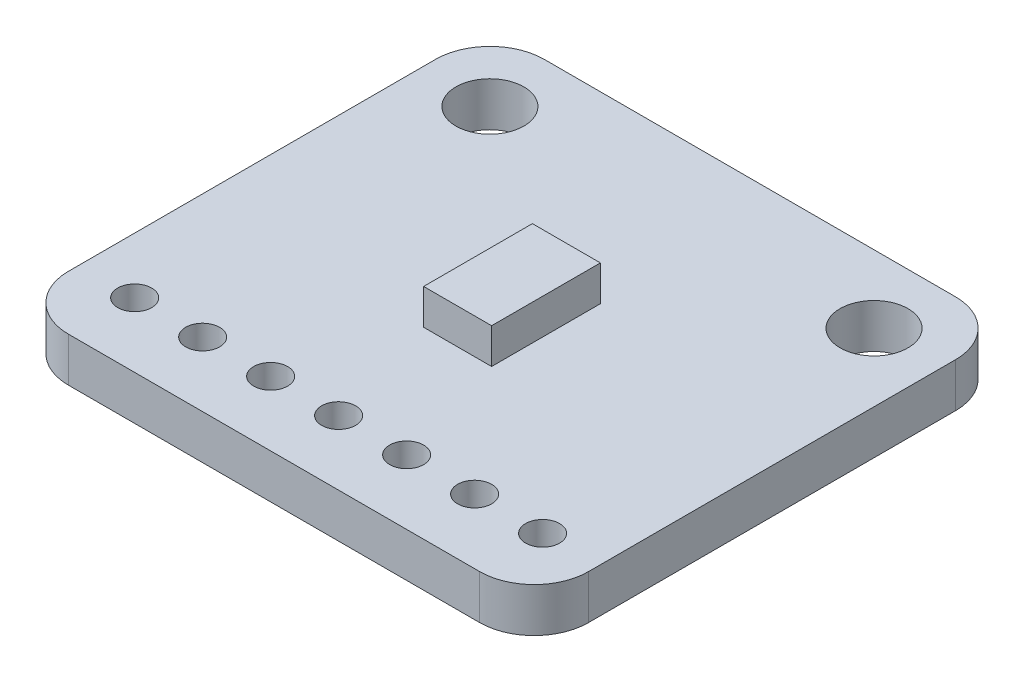
ISO-10303-21;
HEADER;
FILE_DESCRIPTION(('STEP AP214'),'2;1');
FILE_NAME('part.step','',(''),(''),'','','');
FILE_SCHEMA(('AUTOMOTIVE_DESIGN { 1 0 10303 214 1 1 1 1 }'));
ENDSEC;
DATA;
#1=APPLICATION_CONTEXT('core data for automotive mechanical design processes');
#2=APPLICATION_PROTOCOL_DEFINITION('international standard','automotive_design',2000,#1);
#3=PRODUCT_CONTEXT('',#1,'mechanical');
#4=PRODUCT('Part','Part','',(#3));
#5=PRODUCT_RELATED_PRODUCT_CATEGORY('part','',(#4));
#6=PRODUCT_DEFINITION_FORMATION('','',#4);
#7=PRODUCT_DEFINITION_CONTEXT('part definition',#1,'design');
#8=PRODUCT_DEFINITION('design','',#6,#7);
#9=PRODUCT_DEFINITION_SHAPE('','',#8);
#10=(LENGTH_UNIT() NAMED_UNIT(*) SI_UNIT(.MILLI.,.METRE.));
#11=(NAMED_UNIT(*) PLANE_ANGLE_UNIT() SI_UNIT($,.RADIAN.));
#12=(NAMED_UNIT(*) SI_UNIT($,.STERADIAN.) SOLID_ANGLE_UNIT());
#13=UNCERTAINTY_MEASURE_WITH_UNIT(LENGTH_MEASURE(1.E-05),#10,'distance_accuracy_value','');
#14=(GEOMETRIC_REPRESENTATION_CONTEXT(3) GLOBAL_UNCERTAINTY_ASSIGNED_CONTEXT((#13)) GLOBAL_UNIT_ASSIGNED_CONTEXT((#10,
#11,#12)) REPRESENTATION_CONTEXT('',''));
#15=CARTESIAN_POINT('',(0.,0.,0.));
#16=DIRECTION('',(0.,0.,1.));
#17=DIRECTION('',(1.,0.,0.));
#18=AXIS2_PLACEMENT_3D('',#15,#16,#17);
#19=CARTESIAN_POINT('',(2.032,1.651,-2.032));
#20=DIRECTION('',(0.,-1.,0.));
#21=DIRECTION('',(0.,0.,-1.));
#22=AXIS2_PLACEMENT_3D('',#19,#20,#21);
#23=PLANE('',#22);
#24=CARTESIAN_POINT('',(17.3355,1.651,-2.413));
#25=DIRECTION('',(0.,1.,0.));
#26=DIRECTION('',(0.,0.,1.));
#27=AXIS2_PLACEMENT_3D('',#24,#25,#26);
#28=CIRCLE('',#27,0.634999999999999);
#29=CARTESIAN_POINT('',(17.3355,1.651,-1.778));
#30=VERTEX_POINT('',#29);
#31=EDGE_CURVE('E243',#30,#30,#28,.T.);
#32=ORIENTED_EDGE('',*,*,#31,.F.);
#33=EDGE_LOOP('',(#32));
#34=FACE_BOUND('',#33,.T.);
#35=CARTESIAN_POINT('',(14.7955,1.651,-2.413));
#36=DIRECTION('',(0.,1.,0.));
#37=DIRECTION('',(0.,0.,1.));
#38=AXIS2_PLACEMENT_3D('',#35,#36,#37);
#39=CIRCLE('',#38,0.634999999999999);
#40=CARTESIAN_POINT('',(14.7955,1.651,-1.778));
#41=VERTEX_POINT('',#40);
#42=EDGE_CURVE('E237',#41,#41,#39,.T.);
#43=ORIENTED_EDGE('',*,*,#42,.F.);
#44=EDGE_LOOP('',(#43));
#45=FACE_BOUND('',#44,.T.);
#46=CARTESIAN_POINT('',(12.2555,1.651,-2.413));
#47=DIRECTION('',(0.,1.,0.));
#48=DIRECTION('',(0.,0.,1.));
#49=AXIS2_PLACEMENT_3D('',#46,#47,#48);
#50=CIRCLE('',#49,0.634999999999999);
#51=CARTESIAN_POINT('',(12.2555,1.651,-1.778));
#52=VERTEX_POINT('',#51);
#53=EDGE_CURVE('E231',#52,#52,#50,.T.);
#54=ORIENTED_EDGE('',*,*,#53,.F.);
#55=EDGE_LOOP('',(#54));
#56=FACE_BOUND('',#55,.T.);
#57=CARTESIAN_POINT('',(9.7155,1.651,-2.413));
#58=DIRECTION('',(0.,1.,0.));
#59=DIRECTION('',(0.,0.,1.));
#60=AXIS2_PLACEMENT_3D('',#57,#58,#59);
#61=CIRCLE('',#60,0.634999999999999);
#62=CARTESIAN_POINT('',(9.7155,1.651,-1.778));
#63=VERTEX_POINT('',#62);
#64=EDGE_CURVE('E225',#63,#63,#61,.T.);
#65=ORIENTED_EDGE('',*,*,#64,.F.);
#66=EDGE_LOOP('',(#65));
#67=FACE_BOUND('',#66,.T.);
#68=CARTESIAN_POINT('',(7.1755,1.651,-2.413));
#69=DIRECTION('',(0.,1.,0.));
#70=DIRECTION('',(0.,0.,1.));
#71=AXIS2_PLACEMENT_3D('',#68,#69,#70);
#72=CIRCLE('',#71,0.635000000000001);
#73=CARTESIAN_POINT('',(7.1755,1.651,-1.778));
#74=VERTEX_POINT('',#73);
#75=EDGE_CURVE('E219',#74,#74,#72,.T.);
#76=ORIENTED_EDGE('',*,*,#75,.F.);
#77=EDGE_LOOP('',(#76));
#78=FACE_BOUND('',#77,.T.);
#79=CARTESIAN_POINT('',(4.6355,1.651,-2.413));
#80=DIRECTION('',(0.,1.,0.));
#81=DIRECTION('',(0.,0.,1.));
#82=AXIS2_PLACEMENT_3D('',#79,#80,#81);
#83=CIRCLE('',#82,0.635000000000001);
#84=CARTESIAN_POINT('',(4.6355,1.651,-1.778));
#85=VERTEX_POINT('',#84);
#86=EDGE_CURVE('E213',#85,#85,#83,.T.);
#87=ORIENTED_EDGE('',*,*,#86,.F.);
#88=EDGE_LOOP('',(#87));
#89=FACE_BOUND('',#88,.T.);
#90=CARTESIAN_POINT('',(2.0955,1.651,-2.413));
#91=DIRECTION('',(0.,1.,0.));
#92=DIRECTION('',(0.,0.,1.));
#93=AXIS2_PLACEMENT_3D('',#90,#91,#92);
#94=CIRCLE('',#93,0.635);
#95=CARTESIAN_POINT('',(2.0955,1.651,-1.778));
#96=VERTEX_POINT('',#95);
#97=EDGE_CURVE('E207',#96,#96,#94,.T.);
#98=ORIENTED_EDGE('',*,*,#97,.F.);
#99=EDGE_LOOP('',(#98));
#100=FACE_BOUND('',#99,.T.);
#101=CARTESIAN_POINT('',(16.891,1.651,-15.24));
#102=DIRECTION('',(0.,1.,0.));
#103=DIRECTION('',(0.,0.,1.));
#104=AXIS2_PLACEMENT_3D('',#101,#102,#103);
#105=CIRCLE('',#104,1.27);
#106=CARTESIAN_POINT('',(16.891,1.651,-13.97));
#107=VERTEX_POINT('',#106);
#108=EDGE_CURVE('E201',#107,#107,#105,.T.);
#109=ORIENTED_EDGE('',*,*,#108,.F.);
#110=EDGE_LOOP('',(#109));
#111=FACE_BOUND('',#110,.T.);
#112=CARTESIAN_POINT('',(2.54,1.651,-15.24));
#113=DIRECTION('',(0.,1.,0.));
#114=DIRECTION('',(0.,0.,1.));
#115=AXIS2_PLACEMENT_3D('',#112,#113,#114);
#116=CIRCLE('',#115,1.27);
#117=CARTESIAN_POINT('',(2.54,1.651,-13.97));
#118=VERTEX_POINT('',#117);
#119=EDGE_CURVE('E152',#118,#118,#116,.T.);
#120=ORIENTED_EDGE('',*,*,#119,.F.);
#121=EDGE_LOOP('',(#120));
#122=FACE_BOUND('',#121,.T.);
#123=CARTESIAN_POINT('',(2.032,1.651,-2.032));
#124=DIRECTION('',(0.,1.,0.));
#125=DIRECTION('',(0.,0.,-1.));
#126=AXIS2_PLACEMENT_3D('',#123,#124,#125);
#127=CIRCLE('',#126,2.032);
#128=CARTESIAN_POINT('',(0.,1.651,-2.03200000000001));
#129=VERTEX_POINT('',#128);
#130=CARTESIAN_POINT('',(2.03200000000001,1.651,0.));
#131=VERTEX_POINT('',#130);
#132=EDGE_CURVE('E164',#129,#131,#127,.T.);
#133=ORIENTED_EDGE('',*,*,#132,.T.);
#134=DIRECTION('',(1.,0.,0.));
#135=VECTOR('',#134,1.);
#136=CARTESIAN_POINT('',(2.03200000000001,1.651,0.));
#137=LINE('',#136,#135);
#138=CARTESIAN_POINT('',(17.399,1.651,0.));
#139=VERTEX_POINT('',#138);
#140=EDGE_CURVE('E104',#131,#139,#137,.T.);
#141=ORIENTED_EDGE('',*,*,#140,.T.);
#142=CARTESIAN_POINT('',(17.399,1.651,-2.032));
#143=DIRECTION('',(0.,1.,0.));
#144=DIRECTION('',(0.,0.,1.));
#145=AXIS2_PLACEMENT_3D('',#142,#143,#144);
#146=CIRCLE('',#145,2.032);
#147=CARTESIAN_POINT('',(19.431,1.651,-2.03200000000001));
#148=VERTEX_POINT('',#147);
#149=EDGE_CURVE('E179',#139,#148,#146,.T.);
#150=ORIENTED_EDGE('',*,*,#149,.T.);
#151=DIRECTION('',(0.,0.,-1.));
#152=VECTOR('',#151,1.);
#153=CARTESIAN_POINT('',(19.431,1.651,-2.03200000000001));
#154=LINE('',#153,#152);
#155=CARTESIAN_POINT('',(19.431,1.651,-15.748));
#156=VERTEX_POINT('',#155);
#157=EDGE_CURVE('E192',#148,#156,#154,.T.);
#158=ORIENTED_EDGE('',*,*,#157,.T.);
#159=CARTESIAN_POINT('',(17.399,1.651,-15.748));
#160=DIRECTION('',(0.,1.,0.));
#161=DIRECTION('',(0.,0.,1.));
#162=AXIS2_PLACEMENT_3D('',#159,#160,#161);
#163=CIRCLE('',#162,2.032);
#164=CARTESIAN_POINT('',(17.399,1.651,-17.78));
#165=VERTEX_POINT('',#164);
#166=EDGE_CURVE('E127',#156,#165,#163,.T.);
#167=ORIENTED_EDGE('',*,*,#166,.T.);
#168=DIRECTION('',(-1.,0.,0.));
#169=VECTOR('',#168,1.);
#170=CARTESIAN_POINT('',(2.03200000000001,1.651,-17.78));
#171=LINE('',#170,#169);
#172=CARTESIAN_POINT('',(2.03200000000001,1.651,-17.78));
#173=VERTEX_POINT('',#172);
#174=EDGE_CURVE('E120',#165,#173,#171,.T.);
#175=ORIENTED_EDGE('',*,*,#174,.T.);
#176=CARTESIAN_POINT('',(2.032,1.651,-15.748));
#177=DIRECTION('',(0.,1.,0.));
#178=DIRECTION('',(0.,0.,-1.));
#179=AXIS2_PLACEMENT_3D('',#176,#177,#178);
#180=CIRCLE('',#179,2.032);
#181=CARTESIAN_POINT('',(0.,1.651,-15.748));
#182=VERTEX_POINT('',#181);
#183=EDGE_CURVE('E124',#173,#182,#180,.T.);
#184=ORIENTED_EDGE('',*,*,#183,.T.);
#185=DIRECTION('',(0.,0.,1.));
#186=VECTOR('',#185,1.);
#187=CARTESIAN_POINT('',(0.,1.651,-2.03200000000001));
#188=LINE('',#187,#186);
#189=EDGE_CURVE('E63',#182,#129,#188,.T.);
#190=ORIENTED_EDGE('',*,*,#189,.T.);
#191=EDGE_LOOP('',(#133,#141,#150,#158,#167,#175,#184,#190));
#192=FACE_BOUND('',#191,.T.);
#193=DIRECTION('',(0.,0.,-1.));
#194=VECTOR('',#193,1.);
#195=CARTESIAN_POINT('',(10.9855,1.651,0.));
#196=LINE('',#195,#194);
#197=CARTESIAN_POINT('',(10.9855,1.651,-6.858));
#198=VERTEX_POINT('',#197);
#199=CARTESIAN_POINT('',(10.9855,1.651,-10.922));
#200=VERTEX_POINT('',#199);
#201=EDGE_CURVE('E270',#198,#200,#196,.T.);
#202=ORIENTED_EDGE('',*,*,#201,.F.);
#203=DIRECTION('',(-1.,0.,0.));
#204=VECTOR('',#203,1.);
#205=CARTESIAN_POINT('',(0.,1.651,-6.858));
#206=LINE('',#205,#204);
#207=CARTESIAN_POINT('',(8.4455,1.651,-6.858));
#208=VERTEX_POINT('',#207);
#209=EDGE_CURVE('E262',#198,#208,#206,.T.);
#210=ORIENTED_EDGE('',*,*,#209,.T.);
#211=DIRECTION('',(0.,0.,1.));
#212=VECTOR('',#211,1.);
#213=CARTESIAN_POINT('',(8.4455,1.651,0.));
#214=LINE('',#213,#212);
#215=CARTESIAN_POINT('',(8.4455,1.651,-10.922));
#216=VERTEX_POINT('',#215);
#217=EDGE_CURVE('E54',#216,#208,#214,.T.);
#218=ORIENTED_EDGE('',*,*,#217,.F.);
#219=DIRECTION('',(1.,0.,0.));
#220=VECTOR('',#219,1.);
#221=CARTESIAN_POINT('',(0.,1.651,-10.922));
#222=LINE('',#221,#220);
#223=EDGE_CURVE('E267',#216,#200,#222,.T.);
#224=ORIENTED_EDGE('',*,*,#223,.T.);
#225=EDGE_LOOP('',(#202,#210,#218,#224));
#226=FACE_BOUND('',#225,.T.);
#227=ADVANCED_FACE('F39',(#34,#45,#56,#67,#78,#89,#100,#111,#122,#192,#226),#23,.F.);
#228=CARTESIAN_POINT('',(2.032,0.,-2.032));
#229=DIRECTION('',(0.,-1.,0.));
#230=DIRECTION('',(0.,0.,-1.));
#231=AXIS2_PLACEMENT_3D('',#228,#229,#230);
#232=PLANE('',#231);
#233=CARTESIAN_POINT('',(14.7955,0.,-2.413));
#234=DIRECTION('',(0.,1.,0.));
#235=DIRECTION('',(0.,0.,1.));
#236=AXIS2_PLACEMENT_3D('',#233,#234,#235);
#237=CIRCLE('',#236,0.634999999999999);
#238=CARTESIAN_POINT('',(14.7955,0.,-1.778));
#239=VERTEX_POINT('',#238);
#240=EDGE_CURVE('E240',#239,#239,#237,.T.);
#241=ORIENTED_EDGE('',*,*,#240,.T.);
#242=EDGE_LOOP('',(#241));
#243=FACE_BOUND('',#242,.T.);
#244=CARTESIAN_POINT('',(9.7155,0.,-2.413));
#245=DIRECTION('',(0.,1.,0.));
#246=DIRECTION('',(0.,0.,1.));
#247=AXIS2_PLACEMENT_3D('',#244,#245,#246);
#248=CIRCLE('',#247,0.634999999999999);
#249=CARTESIAN_POINT('',(9.7155,0.,-1.778));
#250=VERTEX_POINT('',#249);
#251=EDGE_CURVE('E228',#250,#250,#248,.T.);
#252=ORIENTED_EDGE('',*,*,#251,.T.);
#253=EDGE_LOOP('',(#252));
#254=FACE_BOUND('',#253,.T.);
#255=CARTESIAN_POINT('',(4.6355,0.,-2.413));
#256=DIRECTION('',(0.,1.,0.));
#257=DIRECTION('',(0.,0.,1.));
#258=AXIS2_PLACEMENT_3D('',#255,#256,#257);
#259=CIRCLE('',#258,0.635000000000001);
#260=CARTESIAN_POINT('',(4.6355,0.,-1.778));
#261=VERTEX_POINT('',#260);
#262=EDGE_CURVE('E216',#261,#261,#259,.T.);
#263=ORIENTED_EDGE('',*,*,#262,.T.);
#264=EDGE_LOOP('',(#263));
#265=FACE_BOUND('',#264,.T.);
#266=CARTESIAN_POINT('',(16.891,0.,-15.24));
#267=DIRECTION('',(0.,1.,0.));
#268=DIRECTION('',(0.,0.,1.));
#269=AXIS2_PLACEMENT_3D('',#266,#267,#268);
#270=CIRCLE('',#269,1.27);
#271=CARTESIAN_POINT('',(16.891,0.,-13.97));
#272=VERTEX_POINT('',#271);
#273=EDGE_CURVE('E204',#272,#272,#270,.T.);
#274=ORIENTED_EDGE('',*,*,#273,.T.);
#275=EDGE_LOOP('',(#274));
#276=FACE_BOUND('',#275,.T.);
#277=CARTESIAN_POINT('',(2.032,0.,-2.032));
#278=DIRECTION('',(0.,1.,0.));
#279=DIRECTION('',(0.,0.,-1.));
#280=AXIS2_PLACEMENT_3D('',#277,#278,#279);
#281=CIRCLE('',#280,2.032);
#282=CARTESIAN_POINT('',(0.,0.,-2.03200000000001));
#283=VERTEX_POINT('',#282);
#284=CARTESIAN_POINT('',(2.03200000000001,0.,0.));
#285=VERTEX_POINT('',#284);
#286=EDGE_CURVE('E148',#283,#285,#281,.T.);
#287=ORIENTED_EDGE('',*,*,#286,.F.);
#288=DIRECTION('',(0.,0.,1.));
#289=VECTOR('',#288,1.);
#290=CARTESIAN_POINT('',(0.,0.,-2.03200000000001));
#291=LINE('',#290,#289);
#292=CARTESIAN_POINT('',(0.,0.,-15.748));
#293=VERTEX_POINT('',#292);
#294=EDGE_CURVE('E96',#293,#283,#291,.T.);
#295=ORIENTED_EDGE('',*,*,#294,.F.);
#296=CARTESIAN_POINT('',(2.032,0.,-15.748));
#297=DIRECTION('',(0.,1.,0.));
#298=DIRECTION('',(0.,0.,-1.));
#299=AXIS2_PLACEMENT_3D('',#296,#297,#298);
#300=CIRCLE('',#299,2.032);
#301=CARTESIAN_POINT('',(2.03200000000001,0.,-17.78));
#302=VERTEX_POINT('',#301);
#303=EDGE_CURVE('E161',#302,#293,#300,.T.);
#304=ORIENTED_EDGE('',*,*,#303,.F.);
#305=DIRECTION('',(-1.,0.,0.));
#306=VECTOR('',#305,1.);
#307=CARTESIAN_POINT('',(2.03200000000001,0.,-17.78));
#308=LINE('',#307,#306);
#309=CARTESIAN_POINT('',(17.399,0.,-17.78));
#310=VERTEX_POINT('',#309);
#311=EDGE_CURVE('E136',#310,#302,#308,.T.);
#312=ORIENTED_EDGE('',*,*,#311,.F.);
#313=CARTESIAN_POINT('',(17.399,0.,-15.748));
#314=DIRECTION('',(0.,1.,0.));
#315=DIRECTION('',(0.,0.,1.));
#316=AXIS2_PLACEMENT_3D('',#313,#314,#315);
#317=CIRCLE('',#316,2.032);
#318=CARTESIAN_POINT('',(19.431,0.,-15.748));
#319=VERTEX_POINT('',#318);
#320=EDGE_CURVE('E158',#319,#310,#317,.T.);
#321=ORIENTED_EDGE('',*,*,#320,.F.);
#322=DIRECTION('',(0.,0.,-1.));
#323=VECTOR('',#322,1.);
#324=CARTESIAN_POINT('',(19.431,0.,-2.03200000000001));
#325=LINE('',#324,#323);
#326=CARTESIAN_POINT('',(19.431,0.,-2.03200000000001));
#327=VERTEX_POINT('',#326);
#328=EDGE_CURVE('E156',#327,#319,#325,.T.);
#329=ORIENTED_EDGE('',*,*,#328,.F.);
#330=CARTESIAN_POINT('',(17.399,0.,-2.032));
#331=DIRECTION('',(0.,1.,0.));
#332=DIRECTION('',(0.,0.,1.));
#333=AXIS2_PLACEMENT_3D('',#330,#331,#332);
#334=CIRCLE('',#333,2.032);
#335=CARTESIAN_POINT('',(17.399,0.,0.));
#336=VERTEX_POINT('',#335);
#337=EDGE_CURVE('E154',#336,#327,#334,.T.);
#338=ORIENTED_EDGE('',*,*,#337,.F.);
#339=DIRECTION('',(1.,0.,0.));
#340=VECTOR('',#339,1.);
#341=CARTESIAN_POINT('',(2.03200000000001,0.,0.));
#342=LINE('',#341,#340);
#343=EDGE_CURVE('E151',#285,#336,#342,.T.);
#344=ORIENTED_EDGE('',*,*,#343,.F.);
#345=EDGE_LOOP('',(#287,#295,#304,#312,#321,#329,#338,#344));
#346=FACE_BOUND('',#345,.T.);
#347=CARTESIAN_POINT('',(2.54,0.,-15.24));
#348=DIRECTION('',(0.,1.,0.));
#349=DIRECTION('',(0.,0.,1.));
#350=AXIS2_PLACEMENT_3D('',#347,#348,#349);
#351=CIRCLE('',#350,1.27);
#352=CARTESIAN_POINT('',(2.54,0.,-13.97));
#353=VERTEX_POINT('',#352);
#354=EDGE_CURVE('E198',#353,#353,#351,.T.);
#355=ORIENTED_EDGE('',*,*,#354,.T.);
#356=EDGE_LOOP('',(#355));
#357=FACE_BOUND('',#356,.T.);
#358=CARTESIAN_POINT('',(2.0955,0.,-2.413));
#359=DIRECTION('',(0.,1.,0.));
#360=DIRECTION('',(0.,0.,1.));
#361=AXIS2_PLACEMENT_3D('',#358,#359,#360);
#362=CIRCLE('',#361,0.635);
#363=CARTESIAN_POINT('',(2.0955,0.,-1.778));
#364=VERTEX_POINT('',#363);
#365=EDGE_CURVE('E210',#364,#364,#362,.T.);
#366=ORIENTED_EDGE('',*,*,#365,.T.);
#367=EDGE_LOOP('',(#366));
#368=FACE_BOUND('',#367,.T.);
#369=CARTESIAN_POINT('',(7.1755,0.,-2.413));
#370=DIRECTION('',(0.,1.,0.));
#371=DIRECTION('',(0.,0.,1.));
#372=AXIS2_PLACEMENT_3D('',#369,#370,#371);
#373=CIRCLE('',#372,0.635000000000001);
#374=CARTESIAN_POINT('',(7.1755,0.,-1.778));
#375=VERTEX_POINT('',#374);
#376=EDGE_CURVE('E222',#375,#375,#373,.T.);
#377=ORIENTED_EDGE('',*,*,#376,.T.);
#378=EDGE_LOOP('',(#377));
#379=FACE_BOUND('',#378,.T.);
#380=CARTESIAN_POINT('',(12.2555,0.,-2.413));
#381=DIRECTION('',(0.,1.,0.));
#382=DIRECTION('',(0.,0.,1.));
#383=AXIS2_PLACEMENT_3D('',#380,#381,#382);
#384=CIRCLE('',#383,0.634999999999999);
#385=CARTESIAN_POINT('',(12.2555,0.,-1.778));
#386=VERTEX_POINT('',#385);
#387=EDGE_CURVE('E234',#386,#386,#384,.T.);
#388=ORIENTED_EDGE('',*,*,#387,.T.);
#389=EDGE_LOOP('',(#388));
#390=FACE_BOUND('',#389,.T.);
#391=CARTESIAN_POINT('',(17.3355,0.,-2.413));
#392=DIRECTION('',(0.,1.,0.));
#393=DIRECTION('',(0.,0.,1.));
#394=AXIS2_PLACEMENT_3D('',#391,#392,#393);
#395=CIRCLE('',#394,0.634999999999999);
#396=CARTESIAN_POINT('',(17.3355,0.,-1.778));
#397=VERTEX_POINT('',#396);
#398=EDGE_CURVE('E246',#397,#397,#395,.T.);
#399=ORIENTED_EDGE('',*,*,#398,.T.);
#400=EDGE_LOOP('',(#399));
#401=FACE_BOUND('',#400,.T.);
#402=ADVANCED_FACE('F183',(#243,#254,#265,#276,#346,#357,#368,#379,#390,#401),#232,.T.);
#403=CARTESIAN_POINT('',(2.032,1.651,-2.032));
#404=DIRECTION('',(0.,-1.,0.));
#405=DIRECTION('',(0.,0.,-1.));
#406=AXIS2_PLACEMENT_3D('',#403,#404,#405);
#407=CYLINDRICAL_SURFACE('',#406,2.032);
#408=ORIENTED_EDGE('',*,*,#286,.T.);
#409=DIRECTION('',(0.,-1.,0.));
#410=VECTOR('',#409,1.);
#411=CARTESIAN_POINT('',(2.03200000000001,1.651,0.));
#412=LINE('',#411,#410);
#413=EDGE_CURVE('E11',#131,#285,#412,.T.);
#414=ORIENTED_EDGE('',*,*,#413,.F.);
#415=ORIENTED_EDGE('',*,*,#132,.F.);
#416=DIRECTION('',(0.,-1.,0.));
#417=VECTOR('',#416,1.);
#418=CARTESIAN_POINT('',(0.,1.651,-2.03200000000001));
#419=LINE('',#418,#417);
#420=EDGE_CURVE('E144',#129,#283,#419,.T.);
#421=ORIENTED_EDGE('',*,*,#420,.T.);
#422=EDGE_LOOP('',(#408,#414,#415,#421));
#423=FACE_BOUND('',#422,.T.);
#424=ADVANCED_FACE('F41',(#423),#407,.T.);
#425=CARTESIAN_POINT('',(2.03200000000001,1.651,0.));
#426=DIRECTION('',(0.,0.,-1.));
#427=DIRECTION('',(-1.,0.,0.));
#428=AXIS2_PLACEMENT_3D('',#425,#426,#427);
#429=PLANE('',#428);
#430=ORIENTED_EDGE('',*,*,#343,.T.);
#431=DIRECTION('',(0.,-1.,0.));
#432=VECTOR('',#431,1.);
#433=CARTESIAN_POINT('',(17.399,1.651,0.));
#434=LINE('',#433,#432);
#435=EDGE_CURVE('E47',#139,#336,#434,.T.);
#436=ORIENTED_EDGE('',*,*,#435,.F.);
#437=ORIENTED_EDGE('',*,*,#140,.F.);
#438=ORIENTED_EDGE('',*,*,#413,.T.);
#439=EDGE_LOOP('',(#430,#436,#437,#438));
#440=FACE_BOUND('',#439,.T.);
#441=ADVANCED_FACE('F337',(#440),#429,.F.);
#442=CARTESIAN_POINT('',(17.399,1.651,-2.032));
#443=DIRECTION('',(0.,-1.,0.));
#444=DIRECTION('',(0.,0.,-1.));
#445=AXIS2_PLACEMENT_3D('',#442,#443,#444);
#446=CYLINDRICAL_SURFACE('',#445,2.032);
#447=ORIENTED_EDGE('',*,*,#337,.T.);
#448=DIRECTION('',(0.,-1.,0.));
#449=VECTOR('',#448,1.);
#450=CARTESIAN_POINT('',(19.431,1.651,-2.03200000000001));
#451=LINE('',#450,#449);
#452=EDGE_CURVE('E171',#148,#327,#451,.T.);
#453=ORIENTED_EDGE('',*,*,#452,.F.);
#454=ORIENTED_EDGE('',*,*,#149,.F.);
#455=ORIENTED_EDGE('',*,*,#435,.T.);
#456=EDGE_LOOP('',(#447,#453,#454,#455));
#457=FACE_BOUND('',#456,.T.);
#458=ADVANCED_FACE('F177',(#457),#446,.T.);
#459=CARTESIAN_POINT('',(19.431,1.651,-2.03200000000001));
#460=DIRECTION('',(-1.,0.,0.));
#461=DIRECTION('',(0.,0.,1.));
#462=AXIS2_PLACEMENT_3D('',#459,#460,#461);
#463=PLANE('',#462);
#464=ORIENTED_EDGE('',*,*,#328,.T.);
#465=DIRECTION('',(0.,-1.,0.));
#466=VECTOR('',#465,1.);
#467=CARTESIAN_POINT('',(19.431,1.651,-15.748));
#468=LINE('',#467,#466);
#469=EDGE_CURVE('E168',#156,#319,#468,.T.);
#470=ORIENTED_EDGE('',*,*,#469,.F.);
#471=ORIENTED_EDGE('',*,*,#157,.F.);
#472=ORIENTED_EDGE('',*,*,#452,.T.);
#473=EDGE_LOOP('',(#464,#470,#471,#472));
#474=FACE_BOUND('',#473,.T.);
#475=ADVANCED_FACE('F188',(#474),#463,.F.);
#476=CARTESIAN_POINT('',(17.399,1.651,-15.748));
#477=DIRECTION('',(0.,-1.,0.));
#478=DIRECTION('',(0.,0.,-1.));
#479=AXIS2_PLACEMENT_3D('',#476,#477,#478);
#480=CYLINDRICAL_SURFACE('',#479,2.032);
#481=ORIENTED_EDGE('',*,*,#320,.T.);
#482=DIRECTION('',(0.,-1.,0.));
#483=VECTOR('',#482,1.);
#484=CARTESIAN_POINT('',(17.399,1.651,-17.78));
#485=LINE('',#484,#483);
#486=EDGE_CURVE('E139',#165,#310,#485,.T.);
#487=ORIENTED_EDGE('',*,*,#486,.F.);
#488=ORIENTED_EDGE('',*,*,#166,.F.);
#489=ORIENTED_EDGE('',*,*,#469,.T.);
#490=EDGE_LOOP('',(#481,#487,#488,#489));
#491=FACE_BOUND('',#490,.T.);
#492=ADVANCED_FACE('F191',(#491),#480,.T.);
#493=CARTESIAN_POINT('',(2.03200000000001,1.651,-17.78));
#494=DIRECTION('',(0.,0.,1.));
#495=DIRECTION('',(1.,0.,0.));
#496=AXIS2_PLACEMENT_3D('',#493,#494,#495);
#497=PLANE('',#496);
#498=ORIENTED_EDGE('',*,*,#311,.T.);
#499=DIRECTION('',(0.,-1.,0.));
#500=VECTOR('',#499,1.);
#501=CARTESIAN_POINT('',(2.03200000000001,1.651,-17.78));
#502=LINE('',#501,#500);
#503=EDGE_CURVE('E133',#173,#302,#502,.T.);
#504=ORIENTED_EDGE('',*,*,#503,.F.);
#505=ORIENTED_EDGE('',*,*,#174,.F.);
#506=ORIENTED_EDGE('',*,*,#486,.T.);
#507=EDGE_LOOP('',(#498,#504,#505,#506));
#508=FACE_BOUND('',#507,.T.);
#509=ADVANCED_FACE('F134',(#508),#497,.F.);
#510=CARTESIAN_POINT('',(2.032,1.651,-15.748));
#511=DIRECTION('',(0.,-1.,0.));
#512=DIRECTION('',(0.,0.,-1.));
#513=AXIS2_PLACEMENT_3D('',#510,#511,#512);
#514=CYLINDRICAL_SURFACE('',#513,2.032);
#515=ORIENTED_EDGE('',*,*,#303,.T.);
#516=DIRECTION('',(0.,-1.,0.));
#517=VECTOR('',#516,1.);
#518=CARTESIAN_POINT('',(0.,1.651,-15.748));
#519=LINE('',#518,#517);
#520=EDGE_CURVE('E140',#182,#293,#519,.T.);
#521=ORIENTED_EDGE('',*,*,#520,.F.);
#522=ORIENTED_EDGE('',*,*,#183,.F.);
#523=ORIENTED_EDGE('',*,*,#503,.T.);
#524=EDGE_LOOP('',(#515,#521,#522,#523));
#525=FACE_BOUND('',#524,.T.);
#526=ADVANCED_FACE('F142',(#525),#514,.T.);
#527=CARTESIAN_POINT('',(0.,1.651,-2.03200000000001));
#528=DIRECTION('',(1.,0.,0.));
#529=DIRECTION('',(0.,0.,-1.));
#530=AXIS2_PLACEMENT_3D('',#527,#528,#529);
#531=PLANE('',#530);
#532=ORIENTED_EDGE('',*,*,#294,.T.);
#533=ORIENTED_EDGE('',*,*,#420,.F.);
#534=ORIENTED_EDGE('',*,*,#189,.F.);
#535=ORIENTED_EDGE('',*,*,#520,.T.);
#536=EDGE_LOOP('',(#532,#533,#534,#535));
#537=FACE_BOUND('',#536,.T.);
#538=ADVANCED_FACE('F325',(#537),#531,.F.);
#539=CARTESIAN_POINT('',(2.54,1.651,-15.24));
#540=DIRECTION('',(0.,-1.,0.));
#541=DIRECTION('',(0.,0.,-1.));
#542=AXIS2_PLACEMENT_3D('',#539,#540,#541);
#543=CYLINDRICAL_SURFACE('',#542,1.27);
#544=ORIENTED_EDGE('',*,*,#119,.T.);
#545=EDGE_LOOP('',(#544));
#546=FACE_BOUND('',#545,.T.);
#547=ORIENTED_EDGE('',*,*,#354,.F.);
#548=EDGE_LOOP('',(#547));
#549=FACE_BOUND('',#548,.T.);
#550=ADVANCED_FACE('F322',(#546,#549),#543,.F.);
#551=CARTESIAN_POINT('',(16.891,1.651,-15.24));
#552=DIRECTION('',(0.,-1.,0.));
#553=DIRECTION('',(0.,0.,-1.));
#554=AXIS2_PLACEMENT_3D('',#551,#552,#553);
#555=CYLINDRICAL_SURFACE('',#554,1.27);
#556=ORIENTED_EDGE('',*,*,#108,.T.);
#557=EDGE_LOOP('',(#556));
#558=FACE_BOUND('',#557,.T.);
#559=ORIENTED_EDGE('',*,*,#273,.F.);
#560=EDGE_LOOP('',(#559));
#561=FACE_BOUND('',#560,.T.);
#562=ADVANCED_FACE('F363',(#558,#561),#555,.F.);
#563=CARTESIAN_POINT('',(2.0955,1.651,-2.413));
#564=DIRECTION('',(0.,-1.,0.));
#565=DIRECTION('',(0.,0.,-1.));
#566=AXIS2_PLACEMENT_3D('',#563,#564,#565);
#567=CYLINDRICAL_SURFACE('',#566,0.635);
#568=ORIENTED_EDGE('',*,*,#97,.T.);
#569=EDGE_LOOP('',(#568));
#570=FACE_BOUND('',#569,.T.);
#571=ORIENTED_EDGE('',*,*,#365,.F.);
#572=EDGE_LOOP('',(#571));
#573=FACE_BOUND('',#572,.T.);
#574=ADVANCED_FACE('F373',(#570,#573),#567,.F.);
#575=CARTESIAN_POINT('',(4.6355,1.651,-2.413));
#576=DIRECTION('',(0.,-1.,0.));
#577=DIRECTION('',(0.,0.,-1.));
#578=AXIS2_PLACEMENT_3D('',#575,#576,#577);
#579=CYLINDRICAL_SURFACE('',#578,0.635000000000001);
#580=ORIENTED_EDGE('',*,*,#86,.T.);
#581=EDGE_LOOP('',(#580));
#582=FACE_BOUND('',#581,.T.);
#583=ORIENTED_EDGE('',*,*,#262,.F.);
#584=EDGE_LOOP('',(#583));
#585=FACE_BOUND('',#584,.T.);
#586=ADVANCED_FACE('F382',(#582,#585),#579,.F.);
#587=CARTESIAN_POINT('',(7.1755,1.651,-2.413));
#588=DIRECTION('',(0.,-1.,0.));
#589=DIRECTION('',(0.,0.,-1.));
#590=AXIS2_PLACEMENT_3D('',#587,#588,#589);
#591=CYLINDRICAL_SURFACE('',#590,0.635000000000001);
#592=ORIENTED_EDGE('',*,*,#75,.T.);
#593=EDGE_LOOP('',(#592));
#594=FACE_BOUND('',#593,.T.);
#595=ORIENTED_EDGE('',*,*,#376,.F.);
#596=EDGE_LOOP('',(#595));
#597=FACE_BOUND('',#596,.T.);
#598=ADVANCED_FACE('F392',(#594,#597),#591,.F.);
#599=CARTESIAN_POINT('',(9.7155,1.651,-2.413));
#600=DIRECTION('',(0.,-1.,0.));
#601=DIRECTION('',(0.,0.,-1.));
#602=AXIS2_PLACEMENT_3D('',#599,#600,#601);
#603=CYLINDRICAL_SURFACE('',#602,0.634999999999999);
#604=ORIENTED_EDGE('',*,*,#64,.T.);
#605=EDGE_LOOP('',(#604));
#606=FACE_BOUND('',#605,.T.);
#607=ORIENTED_EDGE('',*,*,#251,.F.);
#608=EDGE_LOOP('',(#607));
#609=FACE_BOUND('',#608,.T.);
#610=ADVANCED_FACE('F402',(#606,#609),#603,.F.);
#611=CARTESIAN_POINT('',(12.2555,1.651,-2.413));
#612=DIRECTION('',(0.,-1.,0.));
#613=DIRECTION('',(0.,0.,-1.));
#614=AXIS2_PLACEMENT_3D('',#611,#612,#613);
#615=CYLINDRICAL_SURFACE('',#614,0.634999999999999);
#616=ORIENTED_EDGE('',*,*,#53,.T.);
#617=EDGE_LOOP('',(#616));
#618=FACE_BOUND('',#617,.T.);
#619=ORIENTED_EDGE('',*,*,#387,.F.);
#620=EDGE_LOOP('',(#619));
#621=FACE_BOUND('',#620,.T.);
#622=ADVANCED_FACE('F412',(#618,#621),#615,.F.);
#623=CARTESIAN_POINT('',(14.7955,1.651,-2.413));
#624=DIRECTION('',(0.,-1.,0.));
#625=DIRECTION('',(0.,0.,-1.));
#626=AXIS2_PLACEMENT_3D('',#623,#624,#625);
#627=CYLINDRICAL_SURFACE('',#626,0.634999999999999);
#628=ORIENTED_EDGE('',*,*,#42,.T.);
#629=EDGE_LOOP('',(#628));
#630=FACE_BOUND('',#629,.T.);
#631=ORIENTED_EDGE('',*,*,#240,.F.);
#632=EDGE_LOOP('',(#631));
#633=FACE_BOUND('',#632,.T.);
#634=ADVANCED_FACE('F422',(#630,#633),#627,.F.);
#635=CARTESIAN_POINT('',(17.3355,1.651,-2.413));
#636=DIRECTION('',(0.,-1.,0.));
#637=DIRECTION('',(0.,0.,-1.));
#638=AXIS2_PLACEMENT_3D('',#635,#636,#637);
#639=CYLINDRICAL_SURFACE('',#638,0.634999999999999);
#640=ORIENTED_EDGE('',*,*,#31,.T.);
#641=EDGE_LOOP('',(#640));
#642=FACE_BOUND('',#641,.T.);
#643=ORIENTED_EDGE('',*,*,#398,.F.);
#644=EDGE_LOOP('',(#643));
#645=FACE_BOUND('',#644,.T.);
#646=ADVANCED_FACE('F432',(#642,#645),#639,.F.);
#647=CARTESIAN_POINT('',(10.9855,2.9718,0.));
#648=DIRECTION('',(-1.,0.,0.));
#649=DIRECTION('',(0.,0.,1.));
#650=AXIS2_PLACEMENT_3D('',#647,#648,#649);
#651=PLANE('',#650);
#652=ORIENTED_EDGE('',*,*,#201,.T.);
#653=DIRECTION('',(0.,-1.,0.));
#654=VECTOR('',#653,1.);
#655=CARTESIAN_POINT('',(10.9855,2.9718,-10.922));
#656=LINE('',#655,#654);
#657=CARTESIAN_POINT('',(10.9855,2.9718,-10.922));
#658=VERTEX_POINT('',#657);
#659=EDGE_CURVE('E249',#658,#200,#656,.T.);
#660=ORIENTED_EDGE('',*,*,#659,.F.);
#661=DIRECTION('',(0.,0.,-1.));
#662=VECTOR('',#661,1.);
#663=CARTESIAN_POINT('',(10.9855,2.9718,0.));
#664=LINE('',#663,#662);
#665=CARTESIAN_POINT('',(10.9855,2.9718,-6.858));
#666=VERTEX_POINT('',#665);
#667=EDGE_CURVE('E265',#666,#658,#664,.T.);
#668=ORIENTED_EDGE('',*,*,#667,.F.);
#669=DIRECTION('',(0.,-1.,0.));
#670=VECTOR('',#669,1.);
#671=CARTESIAN_POINT('',(10.9855,2.9718,-6.858));
#672=LINE('',#671,#670);
#673=EDGE_CURVE('E258',#666,#198,#672,.T.);
#674=ORIENTED_EDGE('',*,*,#673,.T.);
#675=EDGE_LOOP('',(#652,#660,#668,#674));
#676=FACE_BOUND('',#675,.T.);
#677=ADVANCED_FACE('F292',(#676),#651,.F.);
#678=CARTESIAN_POINT('',(0.,2.9718,-10.922));
#679=DIRECTION('',(0.,0.,-1.));
#680=DIRECTION('',(-1.,0.,0.));
#681=AXIS2_PLACEMENT_3D('',#678,#679,#680);
#682=PLANE('',#681);
#683=ORIENTED_EDGE('',*,*,#223,.F.);
#684=DIRECTION('',(0.,-1.,0.));
#685=VECTOR('',#684,1.);
#686=CARTESIAN_POINT('',(8.4455,2.9718,-10.922));
#687=LINE('',#686,#685);
#688=CARTESIAN_POINT('',(8.4455,2.9718,-10.922));
#689=VERTEX_POINT('',#688);
#690=EDGE_CURVE('E254',#689,#216,#687,.T.);
#691=ORIENTED_EDGE('',*,*,#690,.F.);
#692=DIRECTION('',(1.,0.,0.));
#693=VECTOR('',#692,1.);
#694=CARTESIAN_POINT('',(0.,2.9718,-10.922));
#695=LINE('',#694,#693);
#696=EDGE_CURVE('E278',#689,#658,#695,.T.);
#697=ORIENTED_EDGE('',*,*,#696,.T.);
#698=ORIENTED_EDGE('',*,*,#659,.T.);
#699=EDGE_LOOP('',(#683,#691,#697,#698));
#700=FACE_BOUND('',#699,.T.);
#701=ADVANCED_FACE('F298',(#700),#682,.T.);
#702=CARTESIAN_POINT('',(8.4455,2.9718,0.));
#703=DIRECTION('',(1.,0.,0.));
#704=DIRECTION('',(0.,0.,-1.));
#705=AXIS2_PLACEMENT_3D('',#702,#703,#704);
#706=PLANE('',#705);
#707=ORIENTED_EDGE('',*,*,#217,.T.);
#708=DIRECTION('',(0.,-1.,0.));
#709=VECTOR('',#708,1.);
#710=CARTESIAN_POINT('',(8.4455,2.9718,-6.858));
#711=LINE('',#710,#709);
#712=CARTESIAN_POINT('',(8.4455,2.9718,-6.858));
#713=VERTEX_POINT('',#712);
#714=EDGE_CURVE('E256',#713,#208,#711,.T.);
#715=ORIENTED_EDGE('',*,*,#714,.F.);
#716=DIRECTION('',(0.,0.,1.));
#717=VECTOR('',#716,1.);
#718=CARTESIAN_POINT('',(8.4455,2.9718,0.));
#719=LINE('',#718,#717);
#720=EDGE_CURVE('E275',#689,#713,#719,.T.);
#721=ORIENTED_EDGE('',*,*,#720,.F.);
#722=ORIENTED_EDGE('',*,*,#690,.T.);
#723=EDGE_LOOP('',(#707,#715,#721,#722));
#724=FACE_BOUND('',#723,.T.);
#725=ADVANCED_FACE('F303',(#724),#706,.F.);
#726=CARTESIAN_POINT('',(0.,2.9718,-6.858));
#727=DIRECTION('',(0.,0.,1.));
#728=DIRECTION('',(1.,0.,0.));
#729=AXIS2_PLACEMENT_3D('',#726,#727,#728);
#730=PLANE('',#729);
#731=ORIENTED_EDGE('',*,*,#209,.F.);
#732=ORIENTED_EDGE('',*,*,#673,.F.);
#733=DIRECTION('',(-1.,0.,0.));
#734=VECTOR('',#733,1.);
#735=CARTESIAN_POINT('',(0.,2.9718,-6.858));
#736=LINE('',#735,#734);
#737=EDGE_CURVE('E261',#666,#713,#736,.T.);
#738=ORIENTED_EDGE('',*,*,#737,.T.);
#739=ORIENTED_EDGE('',*,*,#714,.T.);
#740=EDGE_LOOP('',(#731,#732,#738,#739));
#741=FACE_BOUND('',#740,.T.);
#742=ADVANCED_FACE('F310',(#741),#730,.T.);
#743=CARTESIAN_POINT('',(0.,2.9718,0.));
#744=DIRECTION('',(0.,1.,0.));
#745=DIRECTION('',(0.,0.,1.));
#746=AXIS2_PLACEMENT_3D('',#743,#744,#745);
#747=PLANE('',#746);
#748=ORIENTED_EDGE('',*,*,#667,.T.);
#749=ORIENTED_EDGE('',*,*,#696,.F.);
#750=ORIENTED_EDGE('',*,*,#720,.T.);
#751=ORIENTED_EDGE('',*,*,#737,.F.);
#752=EDGE_LOOP('',(#748,#749,#750,#751));
#753=FACE_BOUND('',#752,.T.);
#754=ADVANCED_FACE('F288',(#753),#747,.T.);
#755=CLOSED_SHELL('',(#227,#402,#424,#441,#458,#475,#492,#509,#526,#538,#550,#562,#574,#586,
#598,#610,#622,#634,#646,#677,#701,#725,#742,#754));
#756=MANIFOLD_SOLID_BREP('B2',#755);
#757=ADVANCED_BREP_SHAPE_REPRESENTATION('',(#18,#756),#14);
#758=SHAPE_DEFINITION_REPRESENTATION(#9,#757);
ENDSEC;
END-ISO-10303-21;
